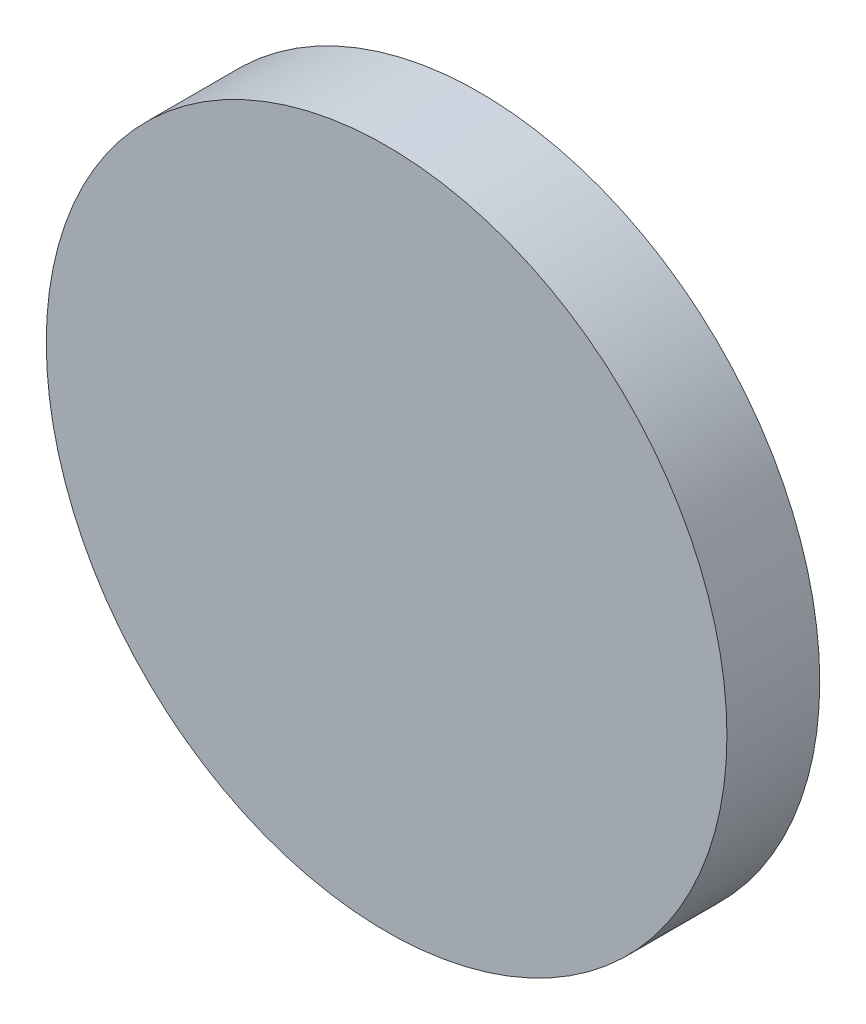
ISO-10303-21;
HEADER;
FILE_DESCRIPTION(('STEP AP214'),'2;1');
FILE_NAME('part.step','',(''),(''),'','','');
FILE_SCHEMA(('AUTOMOTIVE_DESIGN { 1 0 10303 214 1 1 1 1 }'));
ENDSEC;
DATA;
#1=APPLICATION_CONTEXT('core data for automotive mechanical design processes');
#2=APPLICATION_PROTOCOL_DEFINITION('international standard','automotive_design',2000,#1);
#3=PRODUCT_CONTEXT('',#1,'mechanical');
#4=PRODUCT('Part','Part','',(#3));
#5=PRODUCT_RELATED_PRODUCT_CATEGORY('part','',(#4));
#6=PRODUCT_DEFINITION_FORMATION('','',#4);
#7=PRODUCT_DEFINITION_CONTEXT('part definition',#1,'design');
#8=PRODUCT_DEFINITION('design','',#6,#7);
#9=PRODUCT_DEFINITION_SHAPE('','',#8);
#10=(LENGTH_UNIT() NAMED_UNIT(*) SI_UNIT(.MILLI.,.METRE.));
#11=(NAMED_UNIT(*) PLANE_ANGLE_UNIT() SI_UNIT($,.RADIAN.));
#12=(NAMED_UNIT(*) SI_UNIT($,.STERADIAN.) SOLID_ANGLE_UNIT());
#13=UNCERTAINTY_MEASURE_WITH_UNIT(LENGTH_MEASURE(1.E-05),#10,'distance_accuracy_value','');
#14=(GEOMETRIC_REPRESENTATION_CONTEXT(3) GLOBAL_UNCERTAINTY_ASSIGNED_CONTEXT((#13)) GLOBAL_UNIT_ASSIGNED_CONTEXT((#10,
#11,#12)) REPRESENTATION_CONTEXT('',''));
#15=CARTESIAN_POINT('',(0.,0.,0.));
#16=DIRECTION('',(0.,0.,1.));
#17=DIRECTION('',(1.,0.,0.));
#18=AXIS2_PLACEMENT_3D('',#15,#16,#17);
#19=CARTESIAN_POINT('',(0.,0.,2.54));
#20=DIRECTION('',(0.,0.,-1.));
#21=DIRECTION('',(-1.,0.,0.));
#22=AXIS2_PLACEMENT_3D('',#19,#20,#21);
#23=CYLINDRICAL_SURFACE('',#22,9.31421998501273);
#24=CARTESIAN_POINT('',(0.,0.,2.54));
#25=DIRECTION('',(0.,0.,1.));
#26=DIRECTION('',(1.,0.,0.));
#27=AXIS2_PLACEMENT_3D('',#24,#25,#26);
#28=CIRCLE('',#27,9.31421998501273);
#29=CARTESIAN_POINT('',(9.31421998501273,0.,2.54));
#30=VERTEX_POINT('',#29);
#31=EDGE_CURVE('E10',#30,#30,#28,.T.);
#32=ORIENTED_EDGE('',*,*,#31,.F.);
#33=EDGE_LOOP('',(#32));
#34=FACE_BOUND('',#33,.T.);
#35=CARTESIAN_POINT('',(0.,0.,0.));
#36=DIRECTION('',(0.,0.,1.));
#37=DIRECTION('',(1.,0.,0.));
#38=AXIS2_PLACEMENT_3D('',#35,#36,#37);
#39=CIRCLE('',#38,9.31421998501273);
#40=CARTESIAN_POINT('',(9.31421998501273,0.,0.));
#41=VERTEX_POINT('',#40);
#42=EDGE_CURVE('E38',#41,#41,#39,.T.);
#43=ORIENTED_EDGE('',*,*,#42,.T.);
#44=EDGE_LOOP('',(#43));
#45=FACE_BOUND('',#44,.T.);
#46=ADVANCED_FACE('F35',(#34,#45),#23,.T.);
#47=CARTESIAN_POINT('',(0.,0.,2.54));
#48=DIRECTION('',(0.,0.,1.));
#49=DIRECTION('',(1.,0.,0.));
#50=AXIS2_PLACEMENT_3D('',#47,#48,#49);
#51=PLANE('',#50);
#52=ORIENTED_EDGE('',*,*,#31,.T.);
#53=EDGE_LOOP('',(#52));
#54=FACE_BOUND('',#53,.T.);
#55=ADVANCED_FACE('F50',(#54),#51,.T.);
#56=CARTESIAN_POINT('',(0.,0.,0.));
#57=DIRECTION('',(0.,0.,1.));
#58=DIRECTION('',(1.,0.,0.));
#59=AXIS2_PLACEMENT_3D('',#56,#57,#58);
#60=PLANE('',#59);
#61=ORIENTED_EDGE('',*,*,#42,.F.);
#62=EDGE_LOOP('',(#61));
#63=FACE_BOUND('',#62,.T.);
#64=ADVANCED_FACE('F48',(#63),#60,.F.);
#65=CLOSED_SHELL('',(#46,#55,#64));
#66=MANIFOLD_SOLID_BREP('B2',#65);
#67=ADVANCED_BREP_SHAPE_REPRESENTATION('',(#18,#66),#14);
#68=SHAPE_DEFINITION_REPRESENTATION(#9,#67);
ENDSEC;
END-ISO-10303-21;
